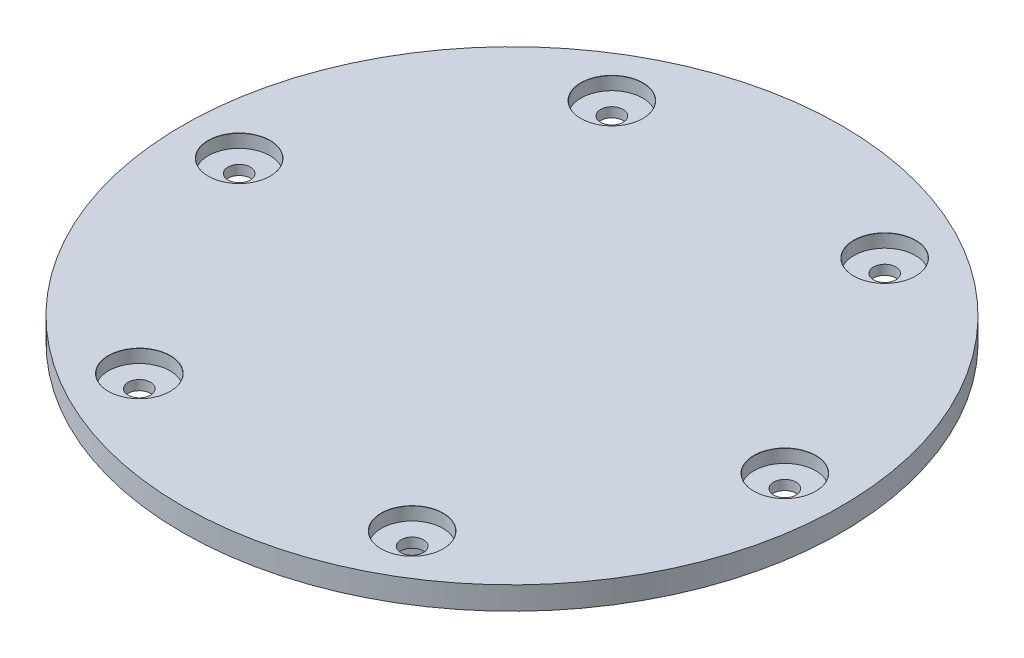
ISO-10303-21;
HEADER;
FILE_DESCRIPTION(('STEP AP214'),'2;1');
FILE_NAME('part.step','',(''),(''),'','','');
FILE_SCHEMA(('AUTOMOTIVE_DESIGN { 1 0 10303 214 1 1 1 1 }'));
ENDSEC;
DATA;
#1=APPLICATION_CONTEXT('core data for automotive mechanical design processes');
#2=APPLICATION_PROTOCOL_DEFINITION('international standard','automotive_design',2000,#1);
#3=PRODUCT_CONTEXT('',#1,'mechanical');
#4=PRODUCT('Part','Part','',(#3));
#5=PRODUCT_RELATED_PRODUCT_CATEGORY('part','',(#4));
#6=PRODUCT_DEFINITION_FORMATION('','',#4);
#7=PRODUCT_DEFINITION_CONTEXT('part definition',#1,'design');
#8=PRODUCT_DEFINITION('design','',#6,#7);
#9=PRODUCT_DEFINITION_SHAPE('','',#8);
#10=(LENGTH_UNIT() NAMED_UNIT(*) SI_UNIT(.MILLI.,.METRE.));
#11=(NAMED_UNIT(*) PLANE_ANGLE_UNIT() SI_UNIT($,.RADIAN.));
#12=(NAMED_UNIT(*) SI_UNIT($,.STERADIAN.) SOLID_ANGLE_UNIT());
#13=UNCERTAINTY_MEASURE_WITH_UNIT(LENGTH_MEASURE(1.E-05),#10,'distance_accuracy_value','');
#14=(GEOMETRIC_REPRESENTATION_CONTEXT(3) GLOBAL_UNCERTAINTY_ASSIGNED_CONTEXT((#13)) GLOBAL_UNIT_ASSIGNED_CONTEXT((#10,
#11,#12)) REPRESENTATION_CONTEXT('',''));
#15=CARTESIAN_POINT('',(0.,0.,0.));
#16=DIRECTION('',(0.,0.,1.));
#17=DIRECTION('',(1.,0.,0.));
#18=AXIS2_PLACEMENT_3D('',#15,#16,#17);
#19=CARTESIAN_POINT('',(0.,-8.03,0.));
#20=DIRECTION('',(0.,1.,0.));
#21=DIRECTION('',(0.,0.,1.));
#22=AXIS2_PLACEMENT_3D('',#19,#20,#21);
#23=CYLINDRICAL_SURFACE('',#22,32.53);
#24=CARTESIAN_POINT('',(0.,-8.03,0.));
#25=DIRECTION('',(0.,1.,0.));
#26=DIRECTION('',(0.,0.,1.));
#27=AXIS2_PLACEMENT_3D('',#24,#25,#26);
#28=CIRCLE('',#27,32.53);
#29=CARTESIAN_POINT('',(0.,-8.03,32.53));
#30=VERTEX_POINT('',#29);
#31=EDGE_CURVE('E10',#30,#30,#28,.T.);
#32=ORIENTED_EDGE('',*,*,#31,.T.);
#33=EDGE_LOOP('',(#32));
#34=FACE_BOUND('',#33,.T.);
#35=CARTESIAN_POINT('',(0.,0.,0.));
#36=DIRECTION('',(0.,1.,0.));
#37=DIRECTION('',(0.,0.,1.));
#38=AXIS2_PLACEMENT_3D('',#35,#36,#37);
#39=CIRCLE('',#38,32.53);
#40=CARTESIAN_POINT('',(0.,0.,32.53));
#41=VERTEX_POINT('',#40);
#42=EDGE_CURVE('E37',#41,#41,#39,.T.);
#43=ORIENTED_EDGE('',*,*,#42,.F.);
#44=EDGE_LOOP('',(#43));
#45=FACE_BOUND('',#44,.T.);
#46=ADVANCED_FACE('F30',(#34,#45),#23,.T.);
#47=CARTESIAN_POINT('',(0.,-8.03,0.));
#48=DIRECTION('',(0.,1.,0.));
#49=DIRECTION('',(0.,0.,1.));
#50=AXIS2_PLACEMENT_3D('',#47,#48,#49);
#51=PLANE('',#50);
#52=ORIENTED_EDGE('',*,*,#31,.F.);
#53=EDGE_LOOP('',(#52));
#54=FACE_BOUND('',#53,.T.);
#55=ADVANCED_FACE('F147',(#54),#51,.F.);
#56=CARTESIAN_POINT('',(0.,3.47,0.));
#57=DIRECTION('',(0.,-1.,0.));
#58=DIRECTION('',(0.,0.,-1.));
#59=AXIS2_PLACEMENT_3D('',#56,#57,#58);
#60=CYLINDRICAL_SURFACE('',#59,49.956);
#61=CARTESIAN_POINT('',(0.,3.47,0.));
#62=DIRECTION('',(0.,1.,0.));
#63=DIRECTION('',(0.,0.,1.));
#64=AXIS2_PLACEMENT_3D('',#61,#62,#63);
#65=CIRCLE('',#64,49.956);
#66=CARTESIAN_POINT('',(0.,3.47,49.956));
#67=VERTEX_POINT('',#66);
#68=EDGE_CURVE('E42',#67,#67,#65,.T.);
#69=ORIENTED_EDGE('',*,*,#68,.F.);
#70=EDGE_LOOP('',(#69));
#71=FACE_BOUND('',#70,.T.);
#72=CARTESIAN_POINT('',(0.,0.,0.));
#73=DIRECTION('',(0.,1.,0.));
#74=DIRECTION('',(0.,0.,1.));
#75=AXIS2_PLACEMENT_3D('',#72,#73,#74);
#76=CIRCLE('',#75,49.956);
#77=CARTESIAN_POINT('',(0.,0.,49.956));
#78=VERTEX_POINT('',#77);
#79=EDGE_CURVE('E45',#78,#78,#76,.T.);
#80=ORIENTED_EDGE('',*,*,#79,.T.);
#81=EDGE_LOOP('',(#80));
#82=FACE_BOUND('',#81,.T.);
#83=ADVANCED_FACE('F127',(#71,#82),#60,.T.);
#84=CARTESIAN_POINT('',(0.,3.47,0.));
#85=DIRECTION('',(0.,1.,0.));
#86=DIRECTION('',(0.,0.,1.));
#87=AXIS2_PLACEMENT_3D('',#84,#85,#86);
#88=PLANE('',#87);
#89=CARTESIAN_POINT('',(-41.356,3.47,0.));
#90=DIRECTION('',(0.,1.,0.));
#91=DIRECTION('',(0.,0.,1.));
#92=AXIS2_PLACEMENT_3D('',#89,#90,#91);
#93=CIRCLE('',#92,4.7005);
#94=CARTESIAN_POINT('',(-41.356,3.47,4.70050000000007));
#95=VERTEX_POINT('',#94);
#96=EDGE_CURVE('E413',#95,#95,#93,.T.);
#97=ORIENTED_EDGE('',*,*,#96,.F.);
#98=EDGE_LOOP('',(#97));
#99=FACE_BOUND('',#98,.T.);
#100=CARTESIAN_POINT('',(-20.678,3.47,-35.8153465989093));
#101=DIRECTION('',(0.,1.,0.));
#102=DIRECTION('',(0.,0.,1.));
#103=AXIS2_PLACEMENT_3D('',#100,#101,#102);
#104=CIRCLE('',#103,4.7005);
#105=CARTESIAN_POINT('',(-20.678,3.47,-31.1148465989093));
#106=VERTEX_POINT('',#105);
#107=EDGE_CURVE('E423',#106,#106,#104,.T.);
#108=ORIENTED_EDGE('',*,*,#107,.F.);
#109=EDGE_LOOP('',(#108));
#110=FACE_BOUND('',#109,.T.);
#111=CARTESIAN_POINT('',(20.6779999999999,3.47,-35.8153465989093));
#112=DIRECTION('',(0.,1.,0.));
#113=DIRECTION('',(0.,0.,1.));
#114=AXIS2_PLACEMENT_3D('',#111,#112,#113);
#115=CIRCLE('',#114,4.7005);
#116=CARTESIAN_POINT('',(20.6779999999999,3.47,-31.1148465989093));
#117=VERTEX_POINT('',#116);
#118=EDGE_CURVE('E68',#117,#117,#115,.T.);
#119=ORIENTED_EDGE('',*,*,#118,.F.);
#120=EDGE_LOOP('',(#119));
#121=FACE_BOUND('',#120,.T.);
#122=CARTESIAN_POINT('',(41.356,3.47,0.));
#123=DIRECTION('',(0.,1.,0.));
#124=DIRECTION('',(0.,0.,1.));
#125=AXIS2_PLACEMENT_3D('',#122,#123,#124);
#126=CIRCLE('',#125,4.7005);
#127=CARTESIAN_POINT('',(41.356,3.47,4.70050000000003));
#128=VERTEX_POINT('',#127);
#129=EDGE_CURVE('E64',#128,#128,#126,.T.);
#130=ORIENTED_EDGE('',*,*,#129,.F.);
#131=EDGE_LOOP('',(#130));
#132=FACE_BOUND('',#131,.T.);
#133=CARTESIAN_POINT('',(20.6780000000001,3.47,35.8153465989092));
#134=DIRECTION('',(0.,1.,0.));
#135=DIRECTION('',(0.,0.,1.));
#136=AXIS2_PLACEMENT_3D('',#133,#134,#135);
#137=CIRCLE('',#136,4.7005);
#138=CARTESIAN_POINT('',(20.6780000000001,3.47,40.5158465989092));
#139=VERTEX_POINT('',#138);
#140=EDGE_CURVE('E60',#139,#139,#137,.T.);
#141=ORIENTED_EDGE('',*,*,#140,.F.);
#142=EDGE_LOOP('',(#141));
#143=FACE_BOUND('',#142,.T.);
#144=CARTESIAN_POINT('',(-20.678,3.47,35.8153465989092));
#145=DIRECTION('',(0.,1.,0.));
#146=DIRECTION('',(0.,0.,1.));
#147=AXIS2_PLACEMENT_3D('',#144,#145,#146);
#148=CIRCLE('',#147,4.7005);
#149=CARTESIAN_POINT('',(-20.678,3.47,40.5158465989092));
#150=VERTEX_POINT('',#149);
#151=EDGE_CURVE('E55',#150,#150,#148,.T.);
#152=ORIENTED_EDGE('',*,*,#151,.F.);
#153=EDGE_LOOP('',(#152));
#154=FACE_BOUND('',#153,.T.);
#155=ORIENTED_EDGE('',*,*,#68,.T.);
#156=EDGE_LOOP('',(#155));
#157=FACE_BOUND('',#156,.T.);
#158=ADVANCED_FACE('F132',(#99,#110,#121,#132,#143,#154,#157),#88,.T.);
#159=CARTESIAN_POINT('',(0.,0.,0.));
#160=DIRECTION('',(0.,1.,0.));
#161=DIRECTION('',(0.,0.,1.));
#162=AXIS2_PLACEMENT_3D('',#159,#160,#161);
#163=PLANE('',#162);
#164=CARTESIAN_POINT('',(-41.356,0.,0.));
#165=DIRECTION('',(0.,1.,0.));
#166=DIRECTION('',(0.,0.,1.));
#167=AXIS2_PLACEMENT_3D('',#164,#165,#166);
#168=CIRCLE('',#167,1.70000000000001);
#169=CARTESIAN_POINT('',(-41.356,0.,1.70000000000008));
#170=VERTEX_POINT('',#169);
#171=EDGE_CURVE('E33',#170,#170,#168,.T.);
#172=ORIENTED_EDGE('',*,*,#171,.T.);
#173=EDGE_LOOP('',(#172));
#174=FACE_BOUND('',#173,.T.);
#175=CARTESIAN_POINT('',(-20.678,0.,-35.8153465989093));
#176=DIRECTION('',(0.,1.,0.));
#177=DIRECTION('',(0.,0.,1.));
#178=AXIS2_PLACEMENT_3D('',#175,#176,#177);
#179=CIRCLE('',#178,1.70000000000001);
#180=CARTESIAN_POINT('',(-20.678,0.,-34.1153465989093));
#181=VERTEX_POINT('',#180);
#182=EDGE_CURVE('E66',#181,#181,#179,.T.);
#183=ORIENTED_EDGE('',*,*,#182,.T.);
#184=EDGE_LOOP('',(#183));
#185=FACE_BOUND('',#184,.T.);
#186=CARTESIAN_POINT('',(20.6779999999999,0.,-35.8153465989093));
#187=DIRECTION('',(0.,1.,0.));
#188=DIRECTION('',(0.,0.,1.));
#189=AXIS2_PLACEMENT_3D('',#186,#187,#188);
#190=CIRCLE('',#189,1.70000000000001);
#191=CARTESIAN_POINT('',(20.6779999999999,0.,-34.1153465989093));
#192=VERTEX_POINT('',#191);
#193=EDGE_CURVE('E62',#192,#192,#190,.T.);
#194=ORIENTED_EDGE('',*,*,#193,.T.);
#195=EDGE_LOOP('',(#194));
#196=FACE_BOUND('',#195,.T.);
#197=CARTESIAN_POINT('',(41.356,0.,0.));
#198=DIRECTION('',(0.,1.,0.));
#199=DIRECTION('',(0.,0.,1.));
#200=AXIS2_PLACEMENT_3D('',#197,#198,#199);
#201=CIRCLE('',#200,1.70000000000001);
#202=CARTESIAN_POINT('',(41.356,0.,1.70000000000004));
#203=VERTEX_POINT('',#202);
#204=EDGE_CURVE('E57',#203,#203,#201,.T.);
#205=ORIENTED_EDGE('',*,*,#204,.T.);
#206=EDGE_LOOP('',(#205));
#207=FACE_BOUND('',#206,.T.);
#208=CARTESIAN_POINT('',(20.6780000000001,0.,35.8153465989092));
#209=DIRECTION('',(0.,1.,0.));
#210=DIRECTION('',(0.,0.,1.));
#211=AXIS2_PLACEMENT_3D('',#208,#209,#210);
#212=CIRCLE('',#211,1.70000000000001);
#213=CARTESIAN_POINT('',(20.6780000000001,0.,37.5153465989092));
#214=VERTEX_POINT('',#213);
#215=EDGE_CURVE('E52',#214,#214,#212,.T.);
#216=ORIENTED_EDGE('',*,*,#215,.T.);
#217=EDGE_LOOP('',(#216));
#218=FACE_BOUND('',#217,.T.);
#219=CARTESIAN_POINT('',(-20.678,0.,35.8153465989092));
#220=DIRECTION('',(0.,1.,0.));
#221=DIRECTION('',(0.,0.,1.));
#222=AXIS2_PLACEMENT_3D('',#219,#220,#221);
#223=CIRCLE('',#222,1.70000000000001);
#224=CARTESIAN_POINT('',(-20.678,0.,37.5153465989092));
#225=VERTEX_POINT('',#224);
#226=EDGE_CURVE('E48',#225,#225,#223,.T.);
#227=ORIENTED_EDGE('',*,*,#226,.T.);
#228=EDGE_LOOP('',(#227));
#229=FACE_BOUND('',#228,.T.);
#230=ORIENTED_EDGE('',*,*,#42,.T.);
#231=EDGE_LOOP('',(#230));
#232=FACE_BOUND('',#231,.T.);
#233=ORIENTED_EDGE('',*,*,#79,.F.);
#234=EDGE_LOOP('',(#233));
#235=FACE_BOUND('',#234,.T.);
#236=ADVANCED_FACE('F129',(#174,#185,#196,#207,#218,#229,#232,#235),#163,.F.);
#237=CARTESIAN_POINT('',(-20.678,3.47,35.8153465989092));
#238=DIRECTION('',(0.,1.,0.));
#239=DIRECTION('',(0.,0.,1.));
#240=AXIS2_PLACEMENT_3D('',#237,#238,#239);
#241=CYLINDRICAL_SURFACE('',#240,1.70000000000001);
#242=CARTESIAN_POINT('',(-20.678,1.47000000000001,35.8153465989092));
#243=DIRECTION('',(0.,1.,0.));
#244=DIRECTION('',(0.,0.,1.));
#245=AXIS2_PLACEMENT_3D('',#242,#243,#244);
#246=CIRCLE('',#245,1.70000000000001);
#247=CARTESIAN_POINT('',(-20.678,1.47000000000001,37.5153465989092));
#248=VERTEX_POINT('',#247);
#249=EDGE_CURVE('E51',#248,#248,#246,.T.);
#250=ORIENTED_EDGE('',*,*,#249,.T.);
#251=EDGE_LOOP('',(#250));
#252=FACE_BOUND('',#251,.T.);
#253=ORIENTED_EDGE('',*,*,#226,.F.);
#254=EDGE_LOOP('',(#253));
#255=FACE_BOUND('',#254,.T.);
#256=ADVANCED_FACE('F131',(#252,#255),#241,.F.);
#257=CARTESIAN_POINT('',(-16.0025,1.47000000000001,35.8153465989092));
#258=DIRECTION('',(0.,-1.,0.));
#259=DIRECTION('',(0.,0.,-1.));
#260=AXIS2_PLACEMENT_3D('',#257,#258,#259);
#261=PLANE('',#260);
#262=ORIENTED_EDGE('',*,*,#249,.F.);
#263=EDGE_LOOP('',(#262));
#264=FACE_BOUND('',#263,.T.);
#265=CARTESIAN_POINT('',(-20.678,1.47000000000001,35.8153465989092));
#266=DIRECTION('',(0.,1.,0.));
#267=DIRECTION('',(0.,0.,1.));
#268=AXIS2_PLACEMENT_3D('',#265,#266,#267);
#269=CIRCLE('',#268,4.6755);
#270=CARTESIAN_POINT('',(-20.678,1.47000000000001,40.4908465989092));
#271=VERTEX_POINT('',#270);
#272=EDGE_CURVE('E117',#271,#271,#269,.T.);
#273=ORIENTED_EDGE('',*,*,#272,.T.);
#274=EDGE_LOOP('',(#273));
#275=FACE_BOUND('',#274,.T.);
#276=ADVANCED_FACE('F139',(#264,#275),#261,.F.);
#277=CARTESIAN_POINT('',(-20.678,3.47,35.8153465989092));
#278=DIRECTION('',(0.,1.,0.));
#279=DIRECTION('',(0.,0.,1.));
#280=AXIS2_PLACEMENT_3D('',#277,#278,#279);
#281=CYLINDRICAL_SURFACE('',#280,4.6755);
#282=ORIENTED_EDGE('',*,*,#272,.F.);
#283=EDGE_LOOP('',(#282));
#284=FACE_BOUND('',#283,.T.);
#285=CARTESIAN_POINT('',(-20.678,3.44500000000001,35.8153465989092));
#286=DIRECTION('',(0.,1.,0.));
#287=DIRECTION('',(0.,0.,1.));
#288=AXIS2_PLACEMENT_3D('',#285,#286,#287);
#289=CIRCLE('',#288,4.6755);
#290=CARTESIAN_POINT('',(-20.678,3.44500000000001,40.4908465989092));
#291=VERTEX_POINT('',#290);
#292=EDGE_CURVE('E114',#291,#291,#289,.T.);
#293=ORIENTED_EDGE('',*,*,#292,.T.);
#294=EDGE_LOOP('',(#293));
#295=FACE_BOUND('',#294,.T.);
#296=ADVANCED_FACE('F184',(#284,#295),#281,.F.);
#297=CARTESIAN_POINT('',(-20.678,3.47,35.8153465989092));
#298=DIRECTION('',(0.,1.,0.));
#299=DIRECTION('',(0.,0.,1.));
#300=AXIS2_PLACEMENT_3D('',#297,#298,#299);
#301=CONICAL_SURFACE('',#300,4.7005,0.78539816339763);
#302=ORIENTED_EDGE('',*,*,#292,.F.);
#303=EDGE_LOOP('',(#302));
#304=FACE_BOUND('',#303,.T.);
#305=ORIENTED_EDGE('',*,*,#151,.T.);
#306=EDGE_LOOP('',(#305));
#307=FACE_BOUND('',#306,.T.);
#308=ADVANCED_FACE('F194',(#304,#307),#301,.F.);
#309=CARTESIAN_POINT('',(20.6780000000001,3.47,35.8153465989092));
#310=DIRECTION('',(0.,1.,0.));
#311=DIRECTION('',(0.,0.,1.));
#312=AXIS2_PLACEMENT_3D('',#309,#310,#311);
#313=CYLINDRICAL_SURFACE('',#312,1.70000000000001);
#314=CARTESIAN_POINT('',(20.6780000000001,1.47000000000001,35.8153465989092));
#315=DIRECTION('',(0.,1.,0.));
#316=DIRECTION('',(0.,0.,1.));
#317=AXIS2_PLACEMENT_3D('',#314,#315,#316);
#318=CIRCLE('',#317,1.70000000000001);
#319=CARTESIAN_POINT('',(20.6780000000001,1.47000000000001,37.5153465989092));
#320=VERTEX_POINT('',#319);
#321=EDGE_CURVE('E56',#320,#320,#318,.T.);
#322=ORIENTED_EDGE('',*,*,#321,.T.);
#323=EDGE_LOOP('',(#322));
#324=FACE_BOUND('',#323,.T.);
#325=ORIENTED_EDGE('',*,*,#215,.F.);
#326=EDGE_LOOP('',(#325));
#327=FACE_BOUND('',#326,.T.);
#328=ADVANCED_FACE('F204',(#324,#327),#313,.F.);
#329=CARTESIAN_POINT('',(25.3535000000001,1.47000000000001,35.8153465989092));
#330=DIRECTION('',(0.,-1.,0.));
#331=DIRECTION('',(0.,0.,-1.));
#332=AXIS2_PLACEMENT_3D('',#329,#330,#331);
#333=PLANE('',#332);
#334=ORIENTED_EDGE('',*,*,#321,.F.);
#335=EDGE_LOOP('',(#334));
#336=FACE_BOUND('',#335,.T.);
#337=CARTESIAN_POINT('',(20.6780000000001,1.47000000000001,35.8153465989092));
#338=DIRECTION('',(0.,1.,0.));
#339=DIRECTION('',(0.,0.,1.));
#340=AXIS2_PLACEMENT_3D('',#337,#338,#339);
#341=CIRCLE('',#340,4.6755);
#342=CARTESIAN_POINT('',(20.6780000000001,1.47000000000001,40.4908465989092));
#343=VERTEX_POINT('',#342);
#344=EDGE_CURVE('E107',#343,#343,#341,.T.);
#345=ORIENTED_EDGE('',*,*,#344,.T.);
#346=EDGE_LOOP('',(#345));
#347=FACE_BOUND('',#346,.T.);
#348=ADVANCED_FACE('F214',(#336,#347),#333,.F.);
#349=CARTESIAN_POINT('',(20.6780000000001,3.47,35.8153465989092));
#350=DIRECTION('',(0.,1.,0.));
#351=DIRECTION('',(0.,0.,1.));
#352=AXIS2_PLACEMENT_3D('',#349,#350,#351);
#353=CYLINDRICAL_SURFACE('',#352,4.6755);
#354=ORIENTED_EDGE('',*,*,#344,.F.);
#355=EDGE_LOOP('',(#354));
#356=FACE_BOUND('',#355,.T.);
#357=CARTESIAN_POINT('',(20.6780000000001,3.44500000000001,35.8153465989092));
#358=DIRECTION('',(0.,1.,0.));
#359=DIRECTION('',(0.,0.,1.));
#360=AXIS2_PLACEMENT_3D('',#357,#358,#359);
#361=CIRCLE('',#360,4.6755);
#362=CARTESIAN_POINT('',(20.6780000000001,3.44500000000001,40.4908465989092));
#363=VERTEX_POINT('',#362);
#364=EDGE_CURVE('E104',#363,#363,#361,.T.);
#365=ORIENTED_EDGE('',*,*,#364,.T.);
#366=EDGE_LOOP('',(#365));
#367=FACE_BOUND('',#366,.T.);
#368=ADVANCED_FACE('F224',(#356,#367),#353,.F.);
#369=CARTESIAN_POINT('',(20.6780000000001,3.47,35.8153465989092));
#370=DIRECTION('',(0.,1.,0.));
#371=DIRECTION('',(0.,0.,1.));
#372=AXIS2_PLACEMENT_3D('',#369,#370,#371);
#373=CONICAL_SURFACE('',#372,4.7005,0.78539816339763);
#374=ORIENTED_EDGE('',*,*,#364,.F.);
#375=EDGE_LOOP('',(#374));
#376=FACE_BOUND('',#375,.T.);
#377=ORIENTED_EDGE('',*,*,#140,.T.);
#378=EDGE_LOOP('',(#377));
#379=FACE_BOUND('',#378,.T.);
#380=ADVANCED_FACE('F234',(#376,#379),#373,.F.);
#381=CARTESIAN_POINT('',(41.356,3.47,0.));
#382=DIRECTION('',(0.,1.,0.));
#383=DIRECTION('',(0.,0.,1.));
#384=AXIS2_PLACEMENT_3D('',#381,#382,#383);
#385=CYLINDRICAL_SURFACE('',#384,1.70000000000001);
#386=CARTESIAN_POINT('',(41.356,1.47000000000001,0.));
#387=DIRECTION('',(0.,1.,0.));
#388=DIRECTION('',(0.,0.,1.));
#389=AXIS2_PLACEMENT_3D('',#386,#387,#388);
#390=CIRCLE('',#389,1.70000000000001);
#391=CARTESIAN_POINT('',(41.356,1.47000000000001,1.70000000000004));
#392=VERTEX_POINT('',#391);
#393=EDGE_CURVE('E61',#392,#392,#390,.T.);
#394=ORIENTED_EDGE('',*,*,#393,.T.);
#395=EDGE_LOOP('',(#394));
#396=FACE_BOUND('',#395,.T.);
#397=ORIENTED_EDGE('',*,*,#204,.F.);
#398=EDGE_LOOP('',(#397));
#399=FACE_BOUND('',#398,.T.);
#400=ADVANCED_FACE('F244',(#396,#399),#385,.F.);
#401=CARTESIAN_POINT('',(46.0315,1.47000000000001,0.));
#402=DIRECTION('',(0.,-1.,0.));
#403=DIRECTION('',(0.,0.,-1.));
#404=AXIS2_PLACEMENT_3D('',#401,#402,#403);
#405=PLANE('',#404);
#406=ORIENTED_EDGE('',*,*,#393,.F.);
#407=EDGE_LOOP('',(#406));
#408=FACE_BOUND('',#407,.T.);
#409=CARTESIAN_POINT('',(41.356,1.47000000000001,0.));
#410=DIRECTION('',(0.,1.,0.));
#411=DIRECTION('',(0.,0.,1.));
#412=AXIS2_PLACEMENT_3D('',#409,#410,#411);
#413=CIRCLE('',#412,4.67549999999999);
#414=CARTESIAN_POINT('',(41.356,1.47000000000001,4.67550000000002));
#415=VERTEX_POINT('',#414);
#416=EDGE_CURVE('E97',#415,#415,#413,.T.);
#417=ORIENTED_EDGE('',*,*,#416,.T.);
#418=EDGE_LOOP('',(#417));
#419=FACE_BOUND('',#418,.T.);
#420=ADVANCED_FACE('F254',(#408,#419),#405,.F.);
#421=CARTESIAN_POINT('',(41.356,3.47,0.));
#422=DIRECTION('',(0.,1.,0.));
#423=DIRECTION('',(0.,0.,1.));
#424=AXIS2_PLACEMENT_3D('',#421,#422,#423);
#425=CYLINDRICAL_SURFACE('',#424,4.67549999999999);
#426=ORIENTED_EDGE('',*,*,#416,.F.);
#427=EDGE_LOOP('',(#426));
#428=FACE_BOUND('',#427,.T.);
#429=CARTESIAN_POINT('',(41.356,3.44500000000001,0.));
#430=DIRECTION('',(0.,1.,0.));
#431=DIRECTION('',(0.,0.,1.));
#432=AXIS2_PLACEMENT_3D('',#429,#430,#431);
#433=CIRCLE('',#432,4.67549999999999);
#434=CARTESIAN_POINT('',(41.356,3.44500000000001,4.67550000000002));
#435=VERTEX_POINT('',#434);
#436=EDGE_CURVE('E94',#435,#435,#433,.T.);
#437=ORIENTED_EDGE('',*,*,#436,.T.);
#438=EDGE_LOOP('',(#437));
#439=FACE_BOUND('',#438,.T.);
#440=ADVANCED_FACE('F264',(#428,#439),#425,.F.);
#441=CARTESIAN_POINT('',(41.356,3.47,0.));
#442=DIRECTION('',(0.,1.,0.));
#443=DIRECTION('',(0.,0.,1.));
#444=AXIS2_PLACEMENT_3D('',#441,#442,#443);
#445=CONICAL_SURFACE('',#444,4.7005,0.785398163397769);
#446=ORIENTED_EDGE('',*,*,#436,.F.);
#447=EDGE_LOOP('',(#446));
#448=FACE_BOUND('',#447,.T.);
#449=ORIENTED_EDGE('',*,*,#129,.T.);
#450=EDGE_LOOP('',(#449));
#451=FACE_BOUND('',#450,.T.);
#452=ADVANCED_FACE('F274',(#448,#451),#445,.F.);
#453=CARTESIAN_POINT('',(20.6779999999999,3.47,-35.8153465989093));
#454=DIRECTION('',(0.,1.,0.));
#455=DIRECTION('',(0.,0.,1.));
#456=AXIS2_PLACEMENT_3D('',#453,#454,#455);
#457=CYLINDRICAL_SURFACE('',#456,1.70000000000001);
#458=CARTESIAN_POINT('',(20.6779999999999,1.47000000000001,-35.8153465989093));
#459=DIRECTION('',(0.,1.,0.));
#460=DIRECTION('',(0.,0.,1.));
#461=AXIS2_PLACEMENT_3D('',#458,#459,#460);
#462=CIRCLE('',#461,1.70000000000001);
#463=CARTESIAN_POINT('',(20.6779999999999,1.47000000000001,-34.1153465989093));
#464=VERTEX_POINT('',#463);
#465=EDGE_CURVE('E65',#464,#464,#462,.T.);
#466=ORIENTED_EDGE('',*,*,#465,.T.);
#467=EDGE_LOOP('',(#466));
#468=FACE_BOUND('',#467,.T.);
#469=ORIENTED_EDGE('',*,*,#193,.F.);
#470=EDGE_LOOP('',(#469));
#471=FACE_BOUND('',#470,.T.);
#472=ADVANCED_FACE('F284',(#468,#471),#457,.F.);
#473=CARTESIAN_POINT('',(25.3534999999999,1.47000000000001,-35.8153465989093));
#474=DIRECTION('',(0.,-1.,0.));
#475=DIRECTION('',(0.,0.,-1.));
#476=AXIS2_PLACEMENT_3D('',#473,#474,#475);
#477=PLANE('',#476);
#478=ORIENTED_EDGE('',*,*,#465,.F.);
#479=EDGE_LOOP('',(#478));
#480=FACE_BOUND('',#479,.T.);
#481=CARTESIAN_POINT('',(20.6779999999999,1.47000000000001,-35.8153465989093));
#482=DIRECTION('',(0.,1.,0.));
#483=DIRECTION('',(0.,0.,1.));
#484=AXIS2_PLACEMENT_3D('',#481,#482,#483);
#485=CIRCLE('',#484,4.6755);
#486=CARTESIAN_POINT('',(20.6779999999999,1.47000000000001,-31.1398465989093));
#487=VERTEX_POINT('',#486);
#488=EDGE_CURVE('E87',#487,#487,#485,.T.);
#489=ORIENTED_EDGE('',*,*,#488,.T.);
#490=EDGE_LOOP('',(#489));
#491=FACE_BOUND('',#490,.T.);
#492=ADVANCED_FACE('F294',(#480,#491),#477,.F.);
#493=CARTESIAN_POINT('',(20.6779999999999,3.47,-35.8153465989093));
#494=DIRECTION('',(0.,1.,0.));
#495=DIRECTION('',(0.,0.,1.));
#496=AXIS2_PLACEMENT_3D('',#493,#494,#495);
#497=CYLINDRICAL_SURFACE('',#496,4.6755);
#498=ORIENTED_EDGE('',*,*,#488,.F.);
#499=EDGE_LOOP('',(#498));
#500=FACE_BOUND('',#499,.T.);
#501=CARTESIAN_POINT('',(20.6779999999999,3.44500000000001,-35.8153465989093));
#502=DIRECTION('',(0.,1.,0.));
#503=DIRECTION('',(0.,0.,1.));
#504=AXIS2_PLACEMENT_3D('',#501,#502,#503);
#505=CIRCLE('',#504,4.6755);
#506=CARTESIAN_POINT('',(20.6779999999999,3.44500000000001,-31.1398465989093));
#507=VERTEX_POINT('',#506);
#508=EDGE_CURVE('E73',#507,#507,#505,.T.);
#509=ORIENTED_EDGE('',*,*,#508,.T.);
#510=EDGE_LOOP('',(#509));
#511=FACE_BOUND('',#510,.T.);
#512=ADVANCED_FACE('F304',(#500,#511),#497,.F.);
#513=CARTESIAN_POINT('',(20.6779999999999,3.47,-35.8153465989093));
#514=DIRECTION('',(0.,1.,0.));
#515=DIRECTION('',(0.,0.,1.));
#516=AXIS2_PLACEMENT_3D('',#513,#514,#515);
#517=CONICAL_SURFACE('',#516,4.7005,0.78539816339763);
#518=ORIENTED_EDGE('',*,*,#508,.F.);
#519=EDGE_LOOP('',(#518));
#520=FACE_BOUND('',#519,.T.);
#521=ORIENTED_EDGE('',*,*,#118,.T.);
#522=EDGE_LOOP('',(#521));
#523=FACE_BOUND('',#522,.T.);
#524=ADVANCED_FACE('F314',(#520,#523),#517,.F.);
#525=CARTESIAN_POINT('',(-20.678,3.47,-35.8153465989093));
#526=DIRECTION('',(0.,1.,0.));
#527=DIRECTION('',(0.,0.,1.));
#528=AXIS2_PLACEMENT_3D('',#525,#526,#527);
#529=CYLINDRICAL_SURFACE('',#528,1.70000000000001);
#530=CARTESIAN_POINT('',(-20.678,1.47000000000001,-35.8153465989093));
#531=DIRECTION('',(0.,1.,0.));
#532=DIRECTION('',(0.,0.,1.));
#533=AXIS2_PLACEMENT_3D('',#530,#531,#532);
#534=CIRCLE('',#533,1.70000000000001);
#535=CARTESIAN_POINT('',(-20.678,1.47000000000001,-34.1153465989093));
#536=VERTEX_POINT('',#535);
#537=EDGE_CURVE('E69',#536,#536,#534,.T.);
#538=ORIENTED_EDGE('',*,*,#537,.T.);
#539=EDGE_LOOP('',(#538));
#540=FACE_BOUND('',#539,.T.);
#541=ORIENTED_EDGE('',*,*,#182,.F.);
#542=EDGE_LOOP('',(#541));
#543=FACE_BOUND('',#542,.T.);
#544=ADVANCED_FACE('F324',(#540,#543),#529,.F.);
#545=CARTESIAN_POINT('',(-16.0025,1.47000000000001,-35.8153465989093));
#546=DIRECTION('',(0.,-1.,0.));
#547=DIRECTION('',(0.,0.,-1.));
#548=AXIS2_PLACEMENT_3D('',#545,#546,#547);
#549=PLANE('',#548);
#550=ORIENTED_EDGE('',*,*,#537,.F.);
#551=EDGE_LOOP('',(#550));
#552=FACE_BOUND('',#551,.T.);
#553=CARTESIAN_POINT('',(-20.678,1.47000000000001,-35.8153465989093));
#554=DIRECTION('',(0.,1.,0.));
#555=DIRECTION('',(0.,0.,1.));
#556=AXIS2_PLACEMENT_3D('',#553,#554,#555);
#557=CIRCLE('',#556,4.6755);
#558=CARTESIAN_POINT('',(-20.678,1.47000000000001,-31.1398465989093));
#559=VERTEX_POINT('',#558);
#560=EDGE_CURVE('E76',#559,#559,#557,.T.);
#561=ORIENTED_EDGE('',*,*,#560,.T.);
#562=EDGE_LOOP('',(#561));
#563=FACE_BOUND('',#562,.T.);
#564=ADVANCED_FACE('F334',(#552,#563),#549,.F.);
#565=CARTESIAN_POINT('',(-20.678,3.47,-35.8153465989093));
#566=DIRECTION('',(0.,1.,0.));
#567=DIRECTION('',(0.,0.,1.));
#568=AXIS2_PLACEMENT_3D('',#565,#566,#567);
#569=CYLINDRICAL_SURFACE('',#568,4.6755);
#570=ORIENTED_EDGE('',*,*,#560,.F.);
#571=EDGE_LOOP('',(#570));
#572=FACE_BOUND('',#571,.T.);
#573=CARTESIAN_POINT('',(-20.678,3.44500000000001,-35.8153465989093));
#574=DIRECTION('',(0.,1.,0.));
#575=DIRECTION('',(0.,0.,1.));
#576=AXIS2_PLACEMENT_3D('',#573,#574,#575);
#577=CIRCLE('',#576,4.6755);
#578=CARTESIAN_POINT('',(-20.678,3.44500000000001,-31.1398465989093));
#579=VERTEX_POINT('',#578);
#580=EDGE_CURVE('E81',#579,#579,#577,.T.);
#581=ORIENTED_EDGE('',*,*,#580,.T.);
#582=EDGE_LOOP('',(#581));
#583=FACE_BOUND('',#582,.T.);
#584=ADVANCED_FACE('F343',(#572,#583),#569,.F.);
#585=CARTESIAN_POINT('',(-20.678,3.47,-35.8153465989093));
#586=DIRECTION('',(0.,1.,0.));
#587=DIRECTION('',(0.,0.,1.));
#588=AXIS2_PLACEMENT_3D('',#585,#586,#587);
#589=CONICAL_SURFACE('',#588,4.7005,0.78539816339763);
#590=ORIENTED_EDGE('',*,*,#580,.F.);
#591=EDGE_LOOP('',(#590));
#592=FACE_BOUND('',#591,.T.);
#593=ORIENTED_EDGE('',*,*,#107,.T.);
#594=EDGE_LOOP('',(#593));
#595=FACE_BOUND('',#594,.T.);
#596=ADVANCED_FACE('F353',(#592,#595),#589,.F.);
#597=CARTESIAN_POINT('',(-41.356,3.47,0.));
#598=DIRECTION('',(0.,1.,0.));
#599=DIRECTION('',(0.,0.,1.));
#600=AXIS2_PLACEMENT_3D('',#597,#598,#599);
#601=CYLINDRICAL_SURFACE('',#600,1.70000000000001);
#602=CARTESIAN_POINT('',(-41.356,1.47000000000001,0.));
#603=DIRECTION('',(0.,1.,0.));
#604=DIRECTION('',(0.,0.,1.));
#605=AXIS2_PLACEMENT_3D('',#602,#603,#604);
#606=CIRCLE('',#605,1.70000000000001);
#607=CARTESIAN_POINT('',(-41.356,1.47000000000001,1.70000000000009));
#608=VERTEX_POINT('',#607);
#609=EDGE_CURVE('E420',#608,#608,#606,.T.);
#610=ORIENTED_EDGE('',*,*,#609,.T.);
#611=EDGE_LOOP('',(#610));
#612=FACE_BOUND('',#611,.T.);
#613=ORIENTED_EDGE('',*,*,#171,.F.);
#614=EDGE_LOOP('',(#613));
#615=FACE_BOUND('',#614,.T.);
#616=ADVANCED_FACE('F363',(#612,#615),#601,.F.);
#617=CARTESIAN_POINT('',(-36.6805,1.47000000000001,0.));
#618=DIRECTION('',(0.,-1.,0.));
#619=DIRECTION('',(0.,0.,-1.));
#620=AXIS2_PLACEMENT_3D('',#617,#618,#619);
#621=PLANE('',#620);
#622=ORIENTED_EDGE('',*,*,#609,.F.);
#623=EDGE_LOOP('',(#622));
#624=FACE_BOUND('',#623,.T.);
#625=CARTESIAN_POINT('',(-41.356,1.47000000000001,0.));
#626=DIRECTION('',(0.,1.,0.));
#627=DIRECTION('',(0.,0.,1.));
#628=AXIS2_PLACEMENT_3D('',#625,#626,#627);
#629=CIRCLE('',#628,4.6755);
#630=CARTESIAN_POINT('',(-41.356,1.47000000000001,4.67550000000007));
#631=VERTEX_POINT('',#630);
#632=EDGE_CURVE('E415',#631,#631,#629,.T.);
#633=ORIENTED_EDGE('',*,*,#632,.T.);
#634=EDGE_LOOP('',(#633));
#635=FACE_BOUND('',#634,.T.);
#636=ADVANCED_FACE('F373',(#624,#635),#621,.F.);
#637=CARTESIAN_POINT('',(-41.356,3.47,0.));
#638=DIRECTION('',(0.,1.,0.));
#639=DIRECTION('',(0.,0.,1.));
#640=AXIS2_PLACEMENT_3D('',#637,#638,#639);
#641=CYLINDRICAL_SURFACE('',#640,4.6755);
#642=ORIENTED_EDGE('',*,*,#632,.F.);
#643=EDGE_LOOP('',(#642));
#644=FACE_BOUND('',#643,.T.);
#645=CARTESIAN_POINT('',(-41.356,3.44500000000001,0.));
#646=DIRECTION('',(0.,1.,0.));
#647=DIRECTION('',(0.,0.,1.));
#648=AXIS2_PLACEMENT_3D('',#645,#646,#647);
#649=CIRCLE('',#648,4.6755);
#650=CARTESIAN_POINT('',(-41.356,3.44500000000001,4.67550000000007));
#651=VERTEX_POINT('',#650);
#652=EDGE_CURVE('E410',#651,#651,#649,.T.);
#653=ORIENTED_EDGE('',*,*,#652,.T.);
#654=EDGE_LOOP('',(#653));
#655=FACE_BOUND('',#654,.T.);
#656=ADVANCED_FACE('F383',(#644,#655),#641,.F.);
#657=CARTESIAN_POINT('',(-41.356,3.47,0.));
#658=DIRECTION('',(0.,1.,0.));
#659=DIRECTION('',(0.,0.,1.));
#660=AXIS2_PLACEMENT_3D('',#657,#658,#659);
#661=CONICAL_SURFACE('',#660,4.7005,0.785398163397492);
#662=ORIENTED_EDGE('',*,*,#652,.F.);
#663=EDGE_LOOP('',(#662));
#664=FACE_BOUND('',#663,.T.);
#665=ORIENTED_EDGE('',*,*,#96,.T.);
#666=EDGE_LOOP('',(#665));
#667=FACE_BOUND('',#666,.T.);
#668=ADVANCED_FACE('F393',(#664,#667),#661,.F.);
#669=CLOSED_SHELL('',(#46,#55,#83,#158,#236,#256,#276,#296,#308,#328,#348,#368,#380,#400,#420,
#440,#452,#472,#492,#512,#524,#544,#564,#584,#596,#616,#636,#656,#668));
#670=MANIFOLD_SOLID_BREP('B2',#669);
#671=ADVANCED_BREP_SHAPE_REPRESENTATION('',(#18,#670),#14);
#672=SHAPE_DEFINITION_REPRESENTATION(#9,#671);
ENDSEC;
END-ISO-10303-21;
